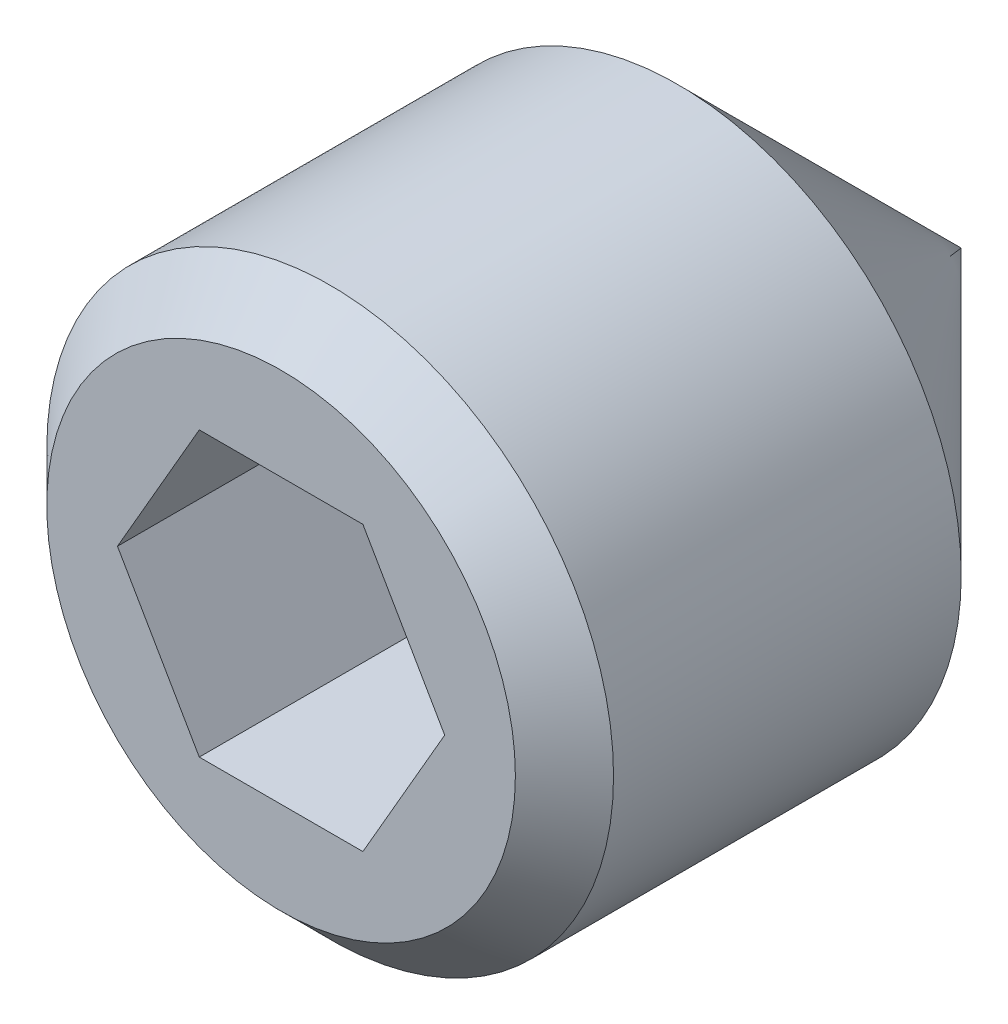
ISO-10303-21;
HEADER;
FILE_DESCRIPTION(('STEP AP214'),'2;1');
FILE_NAME('part.step','',(''),(''),'','','');
FILE_SCHEMA(('AUTOMOTIVE_DESIGN { 1 0 10303 214 1 1 1 1 }'));
ENDSEC;
DATA;
#1=APPLICATION_CONTEXT('core data for automotive mechanical design processes');
#2=APPLICATION_PROTOCOL_DEFINITION('international standard','automotive_design',2000,#1);
#3=PRODUCT_CONTEXT('',#1,'mechanical');
#4=PRODUCT('Part','Part','',(#3));
#5=PRODUCT_RELATED_PRODUCT_CATEGORY('part','',(#4));
#6=PRODUCT_DEFINITION_FORMATION('','',#4);
#7=PRODUCT_DEFINITION_CONTEXT('part definition',#1,'design');
#8=PRODUCT_DEFINITION('design','',#6,#7);
#9=PRODUCT_DEFINITION_SHAPE('','',#8);
#10=(LENGTH_UNIT() NAMED_UNIT(*) SI_UNIT(.MILLI.,.METRE.));
#11=(NAMED_UNIT(*) PLANE_ANGLE_UNIT() SI_UNIT($,.RADIAN.));
#12=(NAMED_UNIT(*) SI_UNIT($,.STERADIAN.) SOLID_ANGLE_UNIT());
#13=UNCERTAINTY_MEASURE_WITH_UNIT(LENGTH_MEASURE(1.E-05),#10,'distance_accuracy_value','');
#14=(GEOMETRIC_REPRESENTATION_CONTEXT(3) GLOBAL_UNCERTAINTY_ASSIGNED_CONTEXT((#13)) GLOBAL_UNIT_ASSIGNED_CONTEXT((#10,
#11,#12)) REPRESENTATION_CONTEXT('',''));
#15=CARTESIAN_POINT('',(0.,0.,0.));
#16=DIRECTION('',(0.,0.,1.));
#17=DIRECTION('',(1.,0.,0.));
#18=AXIS2_PLACEMENT_3D('',#15,#16,#17);
#19=CARTESIAN_POINT('',(0.,2.06699999999996,0.));
#20=DIRECTION('',(0.,0.,-1.));
#21=DIRECTION('',(-0.999999999999999,0.,0.));
#22=AXIS2_PLACEMENT_3D('',#19,#20,#21);
#23=PLANE('',#22);
#24=CARTESIAN_POINT('',(0.,0.,0.));
#25=DIRECTION('',(0.,0.,1.));
#26=DIRECTION('',(0.999999999999999,0.,0.));
#27=AXIS2_PLACEMENT_3D('',#24,#25,#26);
#28=CIRCLE('',#27,2.067);
#29=CARTESIAN_POINT('',(2.067,0.,0.));
#30=VERTEX_POINT('',#29);
#31=EDGE_CURVE('E116',#30,#30,#28,.T.);
#32=ORIENTED_EDGE('',*,*,#31,.T.);
#33=EDGE_LOOP('',(#32));
#34=FACE_BOUND('',#33,.T.);
#35=DIRECTION('',(0.5,-0.866025403784439,0.));
#36=VECTOR('',#35,1.);
#37=CARTESIAN_POINT('',(0.721687500000026,1.24999941718735,0.));
#38=LINE('',#37,#36);
#39=CARTESIAN_POINT('',(0.721687500000026,1.24999941718735,0.));
#40=VERTEX_POINT('',#39);
#41=CARTESIAN_POINT('',(1.44337500000005,0.,-1.38777878078145E-13));
#42=VERTEX_POINT('',#41);
#43=EDGE_CURVE('E30',#40,#42,#38,.T.);
#44=ORIENTED_EDGE('',*,*,#43,.T.);
#45=DIRECTION('',(-0.5,-0.86602540378444,0.));
#46=VECTOR('',#45,1.);
#47=CARTESIAN_POINT('',(1.44337500000005,0.,-1.38777878078145E-13));
#48=LINE('',#47,#46);
#49=CARTESIAN_POINT('',(0.721687500000012,-1.24999941718738,0.));
#50=VERTEX_POINT('',#49);
#51=EDGE_CURVE('E168',#42,#50,#48,.T.);
#52=ORIENTED_EDGE('',*,*,#51,.T.);
#53=DIRECTION('',(-0.999999999999999,0.,0.));
#54=VECTOR('',#53,1.);
#55=CARTESIAN_POINT('',(0.721687500000012,-1.24999941718738,0.));
#56=LINE('',#55,#54);
#57=CARTESIAN_POINT('',(-0.721687499999957,-1.24999941718736,0.));
#58=VERTEX_POINT('',#57);
#59=EDGE_CURVE('E227',#50,#58,#56,.T.);
#60=ORIENTED_EDGE('',*,*,#59,.T.);
#61=DIRECTION('',(-0.5,0.866025403784439,0.));
#62=VECTOR('',#61,1.);
#63=CARTESIAN_POINT('',(-0.721687499999957,-1.24999941718736,0.));
#64=LINE('',#63,#62);
#65=CARTESIAN_POINT('',(-1.44337499999997,0.,0.));
#66=VERTEX_POINT('',#65);
#67=EDGE_CURVE('E222',#58,#66,#64,.T.);
#68=ORIENTED_EDGE('',*,*,#67,.T.);
#69=DIRECTION('',(0.5,0.86602540378444,0.));
#70=VECTOR('',#69,1.);
#71=CARTESIAN_POINT('',(-1.44337499999997,0.,0.));
#72=LINE('',#71,#70);
#73=CARTESIAN_POINT('',(-0.721687499999984,1.24999941718736,0.));
#74=VERTEX_POINT('',#73);
#75=EDGE_CURVE('E101',#66,#74,#72,.T.);
#76=ORIENTED_EDGE('',*,*,#75,.T.);
#77=DIRECTION('',(1.,0.,0.));
#78=VECTOR('',#77,1.);
#79=CARTESIAN_POINT('',(-0.721687499999984,1.24999941718736,0.));
#80=LINE('',#79,#78);
#81=EDGE_CURVE('E93',#74,#40,#80,.T.);
#82=ORIENTED_EDGE('',*,*,#81,.T.);
#83=EDGE_LOOP('',(#44,#52,#60,#68,#76,#82));
#84=FACE_BOUND('',#83,.T.);
#85=ADVANCED_FACE('F15',(#34,#84),#23,.F.);
#86=CARTESIAN_POINT('',(0.,0.,-6.00000000000009));
#87=DIRECTION('',(0.,0.,1.));
#88=DIRECTION('',(0.999999999999999,0.,0.));
#89=AXIS2_PLACEMENT_3D('',#86,#87,#88);
#90=PLANE('',#89);
#91=CARTESIAN_POINT('',(0.,0.,-6.00000000000009));
#92=DIRECTION('',(0.,0.,1.));
#93=DIRECTION('',(0.999999999999999,0.,0.));
#94=AXIS2_PLACEMENT_3D('',#91,#92,#93);
#95=CIRCLE('',#94,5.E-05);
#96=CARTESIAN_POINT('',(5.00000000277555E-05,0.,-6.00000000000009));
#97=VERTEX_POINT('',#96);
#98=EDGE_CURVE('E10',#97,#97,#95,.T.);
#99=ORIENTED_EDGE('',*,*,#98,.F.);
#100=EDGE_LOOP('',(#99));
#101=FACE_BOUND('',#100,.T.);
#102=ADVANCED_FACE('F133',(#101),#90,.F.);
#103=CARTESIAN_POINT('',(0.,0.,-6.00000000000009));
#104=DIRECTION('',(0.,0.,1.));
#105=DIRECTION('',(0.999999999999999,0.,0.));
#106=AXIS2_PLACEMENT_3D('',#103,#104,#105);
#107=CONICAL_SURFACE('',#106,5.E-05,0.785398163397448);
#108=CARTESIAN_POINT('',(0.,0.,-3.50005000000009));
#109=DIRECTION('',(0.,0.,1.));
#110=DIRECTION('',(0.999999999999999,0.,0.));
#111=AXIS2_PLACEMENT_3D('',#108,#109,#110);
#112=CIRCLE('',#111,2.5);
#113=CARTESIAN_POINT('',(2.5,0.,-3.50005000000009));
#114=VERTEX_POINT('',#113);
#115=EDGE_CURVE('E23',#114,#114,#112,.T.);
#116=ORIENTED_EDGE('',*,*,#115,.F.);
#117=EDGE_LOOP('',(#116));
#118=FACE_BOUND('',#117,.T.);
#119=ORIENTED_EDGE('',*,*,#98,.T.);
#120=EDGE_LOOP('',(#119));
#121=FACE_BOUND('',#120,.T.);
#122=ADVANCED_FACE('F130',(#118,#121),#107,.T.);
#123=CARTESIAN_POINT('',(0.,0.,0.));
#124=DIRECTION('',(0.,0.,1.));
#125=DIRECTION('',(0.999999999999999,0.,0.));
#126=AXIS2_PLACEMENT_3D('',#123,#124,#125);
#127=CYLINDRICAL_SURFACE('',#126,2.5);
#128=CARTESIAN_POINT('',(0.,0.,-0.4330000000001));
#129=DIRECTION('',(0.,0.,1.));
#130=DIRECTION('',(0.999999999999999,0.,0.));
#131=AXIS2_PLACEMENT_3D('',#128,#129,#130);
#132=CIRCLE('',#131,2.5);
#133=CARTESIAN_POINT('',(2.5,0.,-0.433000000000101));
#134=VERTEX_POINT('',#133);
#135=EDGE_CURVE('E120',#134,#134,#132,.T.);
#136=ORIENTED_EDGE('',*,*,#135,.F.);
#137=EDGE_LOOP('',(#136));
#138=FACE_BOUND('',#137,.T.);
#139=ORIENTED_EDGE('',*,*,#115,.T.);
#140=EDGE_LOOP('',(#139));
#141=FACE_BOUND('',#140,.T.);
#142=ADVANCED_FACE('F128',(#138,#141),#127,.T.);
#143=CARTESIAN_POINT('',(0.,0.,-0.4330000000001));
#144=DIRECTION('',(0.,0.,-1.));
#145=DIRECTION('',(-0.999999999999999,0.,0.));
#146=AXIS2_PLACEMENT_3D('',#143,#144,#145);
#147=CONICAL_SURFACE('',#146,2.5,0.785398163397448);
#148=ORIENTED_EDGE('',*,*,#31,.F.);
#149=EDGE_LOOP('',(#148));
#150=FACE_BOUND('',#149,.T.);
#151=ORIENTED_EDGE('',*,*,#135,.T.);
#152=EDGE_LOOP('',(#151));
#153=FACE_BOUND('',#152,.T.);
#154=ADVANCED_FACE('F146',(#150,#153),#147,.T.);
#155=CARTESIAN_POINT('',(0.721687499999998,1.24999941718731,-3.83333294479168));
#156=DIRECTION('',(-0.866025403784439,-0.5,0.));
#157=DIRECTION('',(-0.5,0.866025403784439,0.));
#158=AXIS2_PLACEMENT_3D('',#155,#156,#157);
#159=PLANE('',#158);
#160=DIRECTION('',(0.,0.,1.));
#161=VECTOR('',#160,1.);
#162=CARTESIAN_POINT('',(1.44337500000002,0.,-3.83333294479168));
#163=LINE('',#162,#161);
#164=CARTESIAN_POINT('',(1.44337500000002,0.,-3.00000000000006));
#165=VERTEX_POINT('',#164);
#166=EDGE_CURVE('E113',#165,#42,#163,.T.);
#167=ORIENTED_EDGE('',*,*,#166,.T.);
#168=ORIENTED_EDGE('',*,*,#43,.F.);
#169=DIRECTION('',(0.,0.,1.));
#170=VECTOR('',#169,1.);
#171=CARTESIAN_POINT('',(0.721687499999998,1.24999941718731,-3.83333294479168));
#172=LINE('',#171,#170);
#173=CARTESIAN_POINT('',(0.721687500000012,1.24999941718733,-3.00000000000009));
#174=VERTEX_POINT('',#173);
#175=EDGE_CURVE('E86',#174,#40,#172,.T.);
#176=ORIENTED_EDGE('',*,*,#175,.F.);
#177=CARTESIAN_POINT('',(1.44337511547005,-2.00000023486968E-07,-2.99999993333336));
#178=CARTESIAN_POINT('',(1.41166131859363,0.0549297074908359,-3.01831521456547));
#179=CARTESIAN_POINT('',(1.37967376867803,0.110333769154289,-3.03497200513196));
#180=CARTESIAN_POINT('',(1.31514482565827,0.222101177023238,-3.06404593471009));
#181=CARTESIAN_POINT('',(1.28260228637171,0.278466508474859,-3.07645278958685));
#182=CARTESIAN_POINT('',(1.21792049123325,0.390498663979424,-3.09576495630352));
#183=CARTESIAN_POINT('',(1.1857911847247,0.44614825526418,-3.10279881625828));
#184=CARTESIAN_POINT('',(1.12138147134908,0.557709151331739,-3.11119421137978));
#185=CARTESIAN_POINT('',(1.08910129843364,0.613620050898446,-3.11256270032267));
#186=CARTESIAN_POINT('',(1.02878924305478,0.718083595123527,-3.10970852560046));
#187=CARTESIAN_POINT('',(1.00074831033925,0.766651915278406,-3.1061866564376));
#188=CARTESIAN_POINT('',(0.944849122463973,0.863472148780181,-3.09502664894575));
#189=CARTESIAN_POINT('',(0.916991060500722,0.911723727500948,-3.08738470210032));
#190=CARTESIAN_POINT('',(0.860976714749506,1.00874342029479,-3.06828131151935));
#191=CARTESIAN_POINT('',(0.832827516767327,1.05749926139223,-3.05673892743037));
#192=CARTESIAN_POINT('',(0.776948844994097,1.15428395996294,-3.03054259427548));
#193=CARTESIAN_POINT('',(0.749218655883249,1.20231405640644,-3.01589479636618));
#194=CARTESIAN_POINT('',(0.721687384529948,1.24999961718738,-2.99999993333344));
#195=B_SPLINE_CURVE_WITH_KNOTS('',3,(#177,#178,#179,#180,#181,#182,#183,#184,#185,#186,#187,
#188,#189,#190,#191,#192,#193,#194),.UNSPECIFIED.,.F.,.F.,(4,2,2,2,2,2,2,2,4),(0.,
0.198134930654607,0.396745982716096,0.590442024909989,0.783900250554148,0.952317082813944,
1.12088986377895,1.29320078438548,1.46517353084148),.UNSPECIFIED.);
#196=EDGE_CURVE('E78',#165,#174,#195,.T.);
#197=ORIENTED_EDGE('',*,*,#196,.F.);
#198=EDGE_LOOP('',(#167,#168,#176,#197));
#199=FACE_BOUND('',#198,.T.);
#200=ADVANCED_FACE('F87',(#199),#159,.T.);
#201=CARTESIAN_POINT('',(1.44337500000002,0.,-3.83333294479168));
#202=DIRECTION('',(-0.866025403784438,0.500000000000001,0.));
#203=DIRECTION('',(0.5,0.86602540378444,0.));
#204=AXIS2_PLACEMENT_3D('',#201,#202,#203);
#205=PLANE('',#204);
#206=DIRECTION('',(0.,0.,1.));
#207=VECTOR('',#206,1.);
#208=CARTESIAN_POINT('',(0.721687500000012,-1.24999941718739,-3.83333294479163));
#209=LINE('',#208,#207);
#210=CARTESIAN_POINT('',(0.721687499999984,-1.24999941718738,-3.0000000000001));
#211=VERTEX_POINT('',#210);
#212=EDGE_CURVE('E110',#211,#50,#209,.T.);
#213=ORIENTED_EDGE('',*,*,#212,.T.);
#214=ORIENTED_EDGE('',*,*,#51,.F.);
#215=ORIENTED_EDGE('',*,*,#166,.F.);
#216=CARTESIAN_POINT('',(0.721687384529976,-1.24999961718742,-2.99999993333344));
#217=CARTESIAN_POINT('',(0.753401181406373,-1.19506970969654,-3.0183152145655));
#218=CARTESIAN_POINT('',(0.785388731321959,-1.13966564803307,-3.03497200513197));
#219=CARTESIAN_POINT('',(0.849917674341718,-1.02789824016412,-3.0640459347101));
#220=CARTESIAN_POINT('',(0.882460213628276,-0.971532908712501,-3.07645278958686));
#221=CARTESIAN_POINT('',(0.947142008766734,-0.859500753207935,-3.09576495630353));
#222=CARTESIAN_POINT('',(0.979271315275283,-0.803851161923176,-3.10279881625828));
#223=CARTESIAN_POINT('',(1.04368102865091,-0.692290265855628,-3.11119421137981));
#224=CARTESIAN_POINT('',(1.07596120156637,-0.636379366288935,-3.11256270032274));
#225=CARTESIAN_POINT('',(1.13627325694523,-0.531915822063856,-3.10970852560053));
#226=CARTESIAN_POINT('',(1.16431418966074,-0.483347501908968,-3.10618665643763));
#227=CARTESIAN_POINT('',(1.220213377536,-0.386527268407185,-3.09502664894576));
#228=CARTESIAN_POINT('',(1.24807143949926,-0.338275689686419,-3.08738470210033));
#229=CARTESIAN_POINT('',(1.30408578525048,-0.241255996892572,-3.06828131151938));
#230=CARTESIAN_POINT('',(1.33223498323266,-0.192500155795126,-3.05673892743039));
#231=CARTESIAN_POINT('',(1.3881136550059,-0.0957154572244174,-3.03054259427549));
#232=CARTESIAN_POINT('',(1.41584384411675,-0.0476853607809239,-3.01589479636617));
#233=CARTESIAN_POINT('',(1.44337511547007,1.99999995731392E-07,-2.99999993333341));
#234=B_SPLINE_CURVE_WITH_KNOTS('',3,(#216,#217,#218,#219,#220,#221,#222,#223,#224,#225,#226,
#227,#228,#229,#230,#231,#232,#233),.UNSPECIFIED.,.F.,.F.,(4,2,2,2,2,2,2,2,4),(0.,
0.1981349306546,0.396745982716094,0.590442024909984,0.783900250554136,0.952317082813933,
1.12088986377895,1.29320078438548,1.46517353084149),.UNSPECIFIED.);
#235=EDGE_CURVE('E82',#211,#165,#234,.T.);
#236=ORIENTED_EDGE('',*,*,#235,.F.);
#237=EDGE_LOOP('',(#213,#214,#215,#236));
#238=FACE_BOUND('',#237,.T.);
#239=ADVANCED_FACE('F154',(#238),#205,.T.);
#240=CARTESIAN_POINT('',(0.721687500000012,-1.24999941718739,-3.83333294479163));
#241=DIRECTION('',(0.,1.,0.));
#242=DIRECTION('',(0.999999999999999,0.,0.));
#243=AXIS2_PLACEMENT_3D('',#240,#241,#242);
#244=PLANE('',#243);
#245=DIRECTION('',(0.,0.,1.));
#246=VECTOR('',#245,1.);
#247=CARTESIAN_POINT('',(-0.721687499999998,-1.24999941718736,-3.83333294479168));
#248=LINE('',#247,#246);
#249=CARTESIAN_POINT('',(-0.721687499999984,-1.24999941718738,-3.00000000000006));
#250=VERTEX_POINT('',#249);
#251=EDGE_CURVE('E107',#250,#58,#248,.T.);
#252=ORIENTED_EDGE('',*,*,#251,.T.);
#253=ORIENTED_EDGE('',*,*,#59,.F.);
#254=ORIENTED_EDGE('',*,*,#212,.F.);
#255=CARTESIAN_POINT('',(-1.86893053107487,-1.24999941718738,-2.53520610546344));
#256=CARTESIAN_POINT('',(-1.81448238208876,-1.24999941718739,-2.56132804988212));
#257=CARTESIAN_POINT('',(-1.75990061860444,-1.24999941718739,-2.58717651391773));
#258=CARTESIAN_POINT('',(-1.6503973033343,-1.24999941718739,-2.63816964506521));
#259=CARTESIAN_POINT('',(-1.59547568991774,-1.24999941718739,-2.66331417966542));
#260=CARTESIAN_POINT('',(-1.48490363131778,-1.24999941718739,-2.71288371346086));
#261=CARTESIAN_POINT('',(-1.42925078327789,-1.24999941718739,-2.73730337699891));
#262=CARTESIAN_POINT('',(-1.31747292629747,-1.24999941718739,-2.78503003614312));
#263=CARTESIAN_POINT('',(-1.26134794371876,-1.24999941718739,-2.80833709339337));
#264=CARTESIAN_POINT('',(-1.14803909311044,-1.24999941718739,-2.85373906993662));
#265=CARTESIAN_POINT('',(-1.09085026583253,-1.24999941718739,-2.87582177312639));
#266=CARTESIAN_POINT('',(-0.975796584256972,-1.24999941718739,-2.91814344846338));
#267=CARTESIAN_POINT('',(-0.917931648386679,-1.24999941718739,-2.93838219549045));
#268=CARTESIAN_POINT('',(-0.743421107405642,-1.24999941718739,-2.99548539575734));
#269=CARTESIAN_POINT('',(-0.625540546743014,-1.24999941718739,-3.02887063365148));
#270=CARTESIAN_POINT('',(-0.446068633670706,-1.24999941718739,-3.06773730203272));
#271=CARTESIAN_POINT('',(-0.385698752488964,-1.24999941718739,-3.07883352239674));
#272=CARTESIAN_POINT('',(-0.264276574336162,-1.24999941718739,-3.09647257421822));
#273=CARTESIAN_POINT('',(-0.203224267642106,-1.24999941718739,-3.10301534071518));
#274=CARTESIAN_POINT('',(-0.0811129311295969,-1.24999941718739,-3.11097008038643));
#275=CARTESIAN_POINT('',(-0.0200557686730095,-1.24999941718739,-3.1124099520646));
#276=CARTESIAN_POINT('',(0.101941128019158,-1.24999941718739,-3.11010689318597));
#277=CARTESIAN_POINT('',(0.162880885193803,-1.2499994171874,-3.1063651062121));
#278=CARTESIAN_POINT('',(0.313028419419358,-1.2499994171874,-3.0910952969787));
#279=CARTESIAN_POINT('',(0.401946989864182,-1.24999941718739,-3.07671778520719));
#280=CARTESIAN_POINT('',(0.578151442496949,-1.24999941718739,-3.03961622434833));
#281=CARTESIAN_POINT('',(0.66543288385913,-1.24999941718739,-3.01687218538723));
#282=CARTESIAN_POINT('',(0.840085693941168,-1.24999941718739,-2.96490226074127));
#283=CARTESIAN_POINT('',(0.927417091328225,-1.24999941718739,-2.93554521384589));
#284=CARTESIAN_POINT('',(1.05698191353075,-1.24999941718739,-2.88841655550861));
#285=CARTESIAN_POINT('',(1.09981220921255,-1.24999941718739,-2.87224161635578));
#286=CARTESIAN_POINT('',(1.18511527399424,-1.24999941718739,-2.83901402029439));
#287=CARTESIAN_POINT('',(1.22758815679455,-1.24999941718739,-2.82196165582197));
#288=CARTESIAN_POINT('',(1.26991372640979,-1.24999941718738,-2.80455058758602));
#289=B_SPLINE_CURVE_WITH_KNOTS('',3,(#255,#256,#257,#258,#259,#260,#261,#262,#263,#264,#265,
#266,#267,#268,#269,#270,#271,#272,#273,#274,#275,#276,#277,#278,#279,#280,#281,#282,#283,#284,
#285,#286,#287,#288),.UNSPECIFIED.,.F.,.F.,(4,2,2,2,2,2,2,2,2,2,2,2,2,2,2,2,4),(0.,
0.181172538730688,0.362378956153243,0.54469265024367,0.726996231467688,0.910875295921603,
1.0947767793291,1.46154296859818,1.64554776874122,1.82955519388004,2.01255504983148,
2.19551452447364,2.46517537233494,2.7354847418754,3.01171965413391,3.14906153302092,
3.2863579301923),.UNSPECIFIED.);
#290=EDGE_CURVE('E196',#250,#211,#289,.T.);
#291=ORIENTED_EDGE('',*,*,#290,.F.);
#292=EDGE_LOOP('',(#252,#253,#254,#291));
#293=FACE_BOUND('',#292,.T.);
#294=ADVANCED_FACE('F202',(#293),#244,.T.);
#295=CARTESIAN_POINT('',(-0.721687499999998,-1.24999941718736,-3.83333294479168));
#296=DIRECTION('',(0.866025403784439,0.5,0.));
#297=DIRECTION('',(0.5,-0.866025403784439,0.));
#298=AXIS2_PLACEMENT_3D('',#295,#296,#297);
#299=PLANE('',#298);
#300=DIRECTION('',(0.,0.,1.));
#301=VECTOR('',#300,1.);
#302=CARTESIAN_POINT('',(-1.44337499999998,0.,-3.83333294479166));
#303=LINE('',#302,#301);
#304=CARTESIAN_POINT('',(-1.44337499999998,0.,-3.00000000000009));
#305=VERTEX_POINT('',#304);
#306=EDGE_CURVE('E99',#305,#66,#303,.T.);
#307=ORIENTED_EDGE('',*,*,#306,.T.);
#308=ORIENTED_EDGE('',*,*,#67,.F.);
#309=ORIENTED_EDGE('',*,*,#251,.F.);
#310=CARTESIAN_POINT('',(-1.44337511547006,1.99999988792499E-07,-2.99999993333341));
#311=CARTESIAN_POINT('',(-1.41166131859364,-0.0549297074908804,-3.01831521456548));
#312=CARTESIAN_POINT('',(-1.37967376867804,-0.110333769154334,-3.03497200513195));
#313=CARTESIAN_POINT('',(-1.31514482565827,-0.222101177023279,-3.06404593471007));
#314=CARTESIAN_POINT('',(-1.28260228637172,-0.278466508474895,-3.07645278958684));
#315=CARTESIAN_POINT('',(-1.21792049123327,-0.390498663979459,-3.09576495630352));
#316=CARTESIAN_POINT('',(-1.18579118472472,-0.446148255264218,-3.10279881625828));
#317=CARTESIAN_POINT('',(-1.12138147134908,-0.557709151331759,-3.11119421137979));
#318=CARTESIAN_POINT('',(-1.08910129843361,-0.613620050898445,-3.11256270032266));
#319=CARTESIAN_POINT('',(-1.02878924305476,-0.71808359512353,-3.10970852560047));
#320=CARTESIAN_POINT('',(-1.00074831033925,-0.766651915278428,-3.10618665643762));
#321=CARTESIAN_POINT('',(-0.944849122463999,-0.863472148780218,-3.09502664894579));
#322=CARTESIAN_POINT('',(-0.916991060500739,-0.91172372750098,-3.08738470210035));
#323=CARTESIAN_POINT('',(-0.860976714749517,-1.00874342029482,-3.06828131151939));
#324=CARTESIAN_POINT('',(-0.832827516767341,-1.05749926139227,-3.05673892743042));
#325=CARTESIAN_POINT('',(-0.776948844994109,-1.15428395996297,-3.03054259427552));
#326=CARTESIAN_POINT('',(-0.749218655883256,-1.20231405640646,-3.0158947963662));
#327=CARTESIAN_POINT('',(-0.721687384529934,-1.24999961718738,-2.99999993333341));
#328=B_SPLINE_CURVE_WITH_KNOTS('',3,(#310,#311,#312,#313,#314,#315,#316,#317,#318,#319,#320,
#321,#322,#323,#324,#325,#326,#327),.UNSPECIFIED.,.F.,.F.,(4,2,2,2,2,2,2,2,4),(0.,
0.1981349306546,0.396745982716081,0.590442024909969,0.783900250554124,0.952317082813923,
1.12088986377893,1.29320078438546,1.46517353084146),.UNSPECIFIED.);
#329=EDGE_CURVE('E190',#305,#250,#328,.T.);
#330=ORIENTED_EDGE('',*,*,#329,.F.);
#331=EDGE_LOOP('',(#307,#308,#309,#330));
#332=FACE_BOUND('',#331,.T.);
#333=ADVANCED_FACE('F205',(#332),#299,.T.);
#334=CARTESIAN_POINT('',(-1.44337499999998,0.,-3.83333294479166));
#335=DIRECTION('',(0.866025403784438,-0.500000000000001,0.));
#336=DIRECTION('',(-0.5,-0.86602540378444,0.));
#337=AXIS2_PLACEMENT_3D('',#334,#335,#336);
#338=PLANE('',#337);
#339=DIRECTION('',(0.,0.,1.));
#340=VECTOR('',#339,1.);
#341=CARTESIAN_POINT('',(-0.721687499999984,1.24999941718735,-3.83333294479168));
#342=LINE('',#341,#340);
#343=CARTESIAN_POINT('',(-0.721687499999984,1.24999941718732,-3.00000000000003));
#344=VERTEX_POINT('',#343);
#345=EDGE_CURVE('E92',#344,#74,#342,.T.);
#346=ORIENTED_EDGE('',*,*,#345,.T.);
#347=ORIENTED_EDGE('',*,*,#75,.F.);
#348=ORIENTED_EDGE('',*,*,#306,.F.);
#349=CARTESIAN_POINT('',(-0.721687384529907,1.24999961718737,-2.99999993333333));
#350=CARTESIAN_POINT('',(-0.753401181406315,1.1950697096965,-3.01831521456543));
#351=CARTESIAN_POINT('',(-0.785388731321907,1.13966564803304,-3.03497200513192));
#352=CARTESIAN_POINT('',(-0.849917674341673,1.02789824016409,-3.06404593471006));
#353=CARTESIAN_POINT('',(-0.88246021362823,0.97153290871247,-3.07645278958682));
#354=CARTESIAN_POINT('',(-0.947142008766686,0.859500753207899,-3.0957649563035));
#355=CARTESIAN_POINT('',(-0.979271315275232,0.803851161923138,-3.10279881625824));
#356=CARTESIAN_POINT('',(-1.04368102865087,0.692290265855595,-3.11119421137979));
#357=CARTESIAN_POINT('',(-1.07596120156635,0.636379366288909,-3.11256270032272));
#358=CARTESIAN_POINT('',(-1.1362732569452,0.531915822063829,-3.10970852560052));
#359=CARTESIAN_POINT('',(-1.1643141896607,0.483347501908936,-3.10618665643762));
#360=CARTESIAN_POINT('',(-1.22021337753595,0.38652726840715,-3.09502664894575));
#361=CARTESIAN_POINT('',(-1.24807143949921,0.338275689686387,-3.08738470210033));
#362=CARTESIAN_POINT('',(-1.30408578525043,0.241255996892543,-3.06828131151938));
#363=CARTESIAN_POINT('',(-1.33223498323261,0.192500155795096,-3.0567389274304));
#364=CARTESIAN_POINT('',(-1.38811365500585,0.0957154572243878,-3.0305425942755));
#365=CARTESIAN_POINT('',(-1.4158438441167,0.0476853607808946,-3.01589479636619));
#366=CARTESIAN_POINT('',(-1.44337511547003,-2.00000023486968E-07,-2.99999993333344));
#367=B_SPLINE_CURVE_WITH_KNOTS('',3,(#349,#350,#351,#352,#353,#354,#355,#356,#357,#358,#359,
#360,#361,#362,#363,#364,#365,#366),.UNSPECIFIED.,.F.,.F.,(4,2,2,2,2,2,2,2,4),(0.,
0.198134930654605,0.396745982716105,0.590442024909998,0.783900250554152,0.952317082813945,
1.12088986377895,1.29320078438549,1.46517353084149),.UNSPECIFIED.);
#368=EDGE_CURVE('E38',#344,#305,#367,.T.);
#369=ORIENTED_EDGE('',*,*,#368,.F.);
#370=EDGE_LOOP('',(#346,#347,#348,#369));
#371=FACE_BOUND('',#370,.T.);
#372=ADVANCED_FACE('F209',(#371),#338,.T.);
#373=CARTESIAN_POINT('',(-0.721687499999984,1.24999941718735,-3.83333294479168));
#374=DIRECTION('',(0.,-1.,0.));
#375=DIRECTION('',(-1.,0.,0.));
#376=AXIS2_PLACEMENT_3D('',#373,#374,#375);
#377=PLANE('',#376);
#378=ORIENTED_EDGE('',*,*,#175,.T.);
#379=ORIENTED_EDGE('',*,*,#81,.F.);
#380=ORIENTED_EDGE('',*,*,#345,.F.);
#381=CARTESIAN_POINT('',(-1.86893053107484,1.24999941718735,-2.53520610546346));
#382=CARTESIAN_POINT('',(-1.81448238208873,1.24999941718735,-2.56132804988212));
#383=CARTESIAN_POINT('',(-1.7599006186044,1.24999941718735,-2.58717651391771));
#384=CARTESIAN_POINT('',(-1.65039730333426,1.24999941718735,-2.63816964506518));
#385=CARTESIAN_POINT('',(-1.59547568991771,1.24999941718735,-2.66331417966539));
#386=CARTESIAN_POINT('',(-1.48490363131775,1.24999941718735,-2.71288371346084));
#387=CARTESIAN_POINT('',(-1.42925078327785,1.24999941718735,-2.73730337699889));
#388=CARTESIAN_POINT('',(-1.31747292629743,1.24999941718735,-2.78503003614309));
#389=CARTESIAN_POINT('',(-1.26134794371871,1.24999941718735,-2.80833709339334));
#390=CARTESIAN_POINT('',(-1.14803909311039,1.24999941718735,-2.8537390699366));
#391=CARTESIAN_POINT('',(-1.09085026583248,1.24999941718735,-2.87582177312637));
#392=CARTESIAN_POINT('',(-0.975796584256917,1.24999941718735,-2.91814344846335));
#393=CARTESIAN_POINT('',(-0.91793164838662,1.24999941718735,-2.93838219549041));
#394=CARTESIAN_POINT('',(-0.743421107405595,1.24999941718734,-2.99548539575733));
#395=CARTESIAN_POINT('',(-0.625540546743001,1.24999941718733,-3.02887063365159));
#396=CARTESIAN_POINT('',(-0.446068633670687,1.24999941718734,-3.06773730203275));
#397=CARTESIAN_POINT('',(-0.385698752488932,1.24999941718735,-3.07883352239671));
#398=CARTESIAN_POINT('',(-0.264276574336116,1.24999941718735,-3.09647257421814));
#399=CARTESIAN_POINT('',(-0.20322426764206,1.24999941718735,-3.10301534071512));
#400=CARTESIAN_POINT('',(-0.0811129311295458,1.24999941718735,-3.11097008038637));
#401=CARTESIAN_POINT('',(-0.020055768672954,1.24999941718735,-3.11240995206452));
#402=CARTESIAN_POINT('',(0.101941128019222,1.24999941718735,-3.11010689318592));
#403=CARTESIAN_POINT('',(0.162880885193871,1.24999941718734,-3.10636510621209));
#404=CARTESIAN_POINT('',(0.313028419419419,1.24999941718733,-3.09109529697871));
#405=CARTESIAN_POINT('',(0.401946989864227,1.24999941718734,-3.07671778520715));
#406=CARTESIAN_POINT('',(0.578151442496976,1.24999941718735,-3.03961622434825));
#407=CARTESIAN_POINT('',(0.665432883859155,1.24999941718735,-3.01687218538717));
#408=CARTESIAN_POINT('',(0.840085693941188,1.24999941718735,-2.96490226074121));
#409=CARTESIAN_POINT('',(0.927417091328241,1.24999941718735,-2.93554521384583));
#410=CARTESIAN_POINT('',(1.05698191353076,1.24999941718735,-2.88841655550856));
#411=CARTESIAN_POINT('',(1.09981220921255,1.24999941718735,-2.87224161635573));
#412=CARTESIAN_POINT('',(1.18511527399423,1.24999941718735,-2.83901402029435));
#413=CARTESIAN_POINT('',(1.22758815679454,1.24999941718735,-2.82196165582194));
#414=CARTESIAN_POINT('',(1.26991372640978,1.24999941718735,-2.804550587586));
#415=B_SPLINE_CURVE_WITH_KNOTS('',3,(#381,#382,#383,#384,#385,#386,#387,#388,#389,#390,#391,
#392,#393,#394,#395,#396,#397,#398,#399,#400,#401,#402,#403,#404,#405,#406,#407,#408,#409,#410,
#411,#412,#413,#414),.UNSPECIFIED.,.F.,.F.,(4,2,2,2,2,2,2,2,2,2,2,2,2,2,2,2,4),(0.,
0.181172538730679,0.362378956153229,0.544692650243667,0.726996231467694,0.910875295921609,
1.09477677932911,1.46154296859817,1.64554776874121,1.82955519388004,2.0125550498315,
2.19551452447366,2.46517537233493,2.73548474187538,3.01171965413388,3.14906153302088,
3.28635793019224),.UNSPECIFIED.);
#416=EDGE_CURVE('E79',#174,#344,#415,.F.);
#417=ORIENTED_EDGE('',*,*,#416,.F.);
#418=EDGE_LOOP('',(#378,#379,#380,#417));
#419=FACE_BOUND('',#418,.T.);
#420=ADVANCED_FACE('F74',(#419),#377,.T.);
#421=CARTESIAN_POINT('',(0.,0.,-3.83333294479168));
#422=DIRECTION('',(0.,0.,1.));
#423=DIRECTION('',(0.999999999999999,0.,0.));
#424=AXIS2_PLACEMENT_3D('',#421,#422,#423);
#425=CONICAL_SURFACE('',#424,0.,1.0471975511966);
#426=CARTESIAN_POINT('',(0.,0.,-3.83333294479168));
#427=VERTEX_POINT('',#426);
#428=VERTEX_LOOP('',#427);
#429=FACE_BOUND('',#428,.T.);
#430=ORIENTED_EDGE('',*,*,#196,.T.);
#431=ORIENTED_EDGE('',*,*,#416,.T.);
#432=ORIENTED_EDGE('',*,*,#368,.T.);
#433=ORIENTED_EDGE('',*,*,#329,.T.);
#434=ORIENTED_EDGE('',*,*,#290,.T.);
#435=ORIENTED_EDGE('',*,*,#235,.T.);
#436=EDGE_LOOP('',(#430,#431,#432,#433,#434,#435));
#437=FACE_BOUND('',#436,.T.);
#438=ADVANCED_FACE('F71',(#429,#437),#425,.F.);
#439=CLOSED_SHELL('',(#85,#102,#122,#142,#154,#200,#239,#294,#333,#372,#420,#438));
#440=MANIFOLD_SOLID_BREP('B1',#439);
#441=ADVANCED_BREP_SHAPE_REPRESENTATION('',(#18,#440),#14);
#442=SHAPE_DEFINITION_REPRESENTATION(#9,#441);
ENDSEC;
END-ISO-10303-21;
